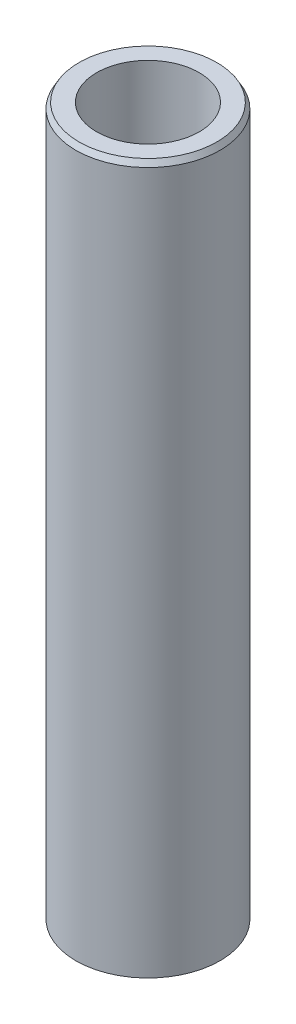
ISO-10303-21;
HEADER;
FILE_DESCRIPTION(('STEP AP214'),'2;1');
FILE_NAME('part.step','',(''),(''),'','','');
FILE_SCHEMA(('AUTOMOTIVE_DESIGN { 1 0 10303 214 1 1 1 1 }'));
ENDSEC;
DATA;
#1=APPLICATION_CONTEXT('core data for automotive mechanical design processes');
#2=APPLICATION_PROTOCOL_DEFINITION('international standard','automotive_design',2000,#1);
#3=PRODUCT_CONTEXT('',#1,'mechanical');
#4=PRODUCT('Part','Part','',(#3));
#5=PRODUCT_RELATED_PRODUCT_CATEGORY('part','',(#4));
#6=PRODUCT_DEFINITION_FORMATION('','',#4);
#7=PRODUCT_DEFINITION_CONTEXT('part definition',#1,'design');
#8=PRODUCT_DEFINITION('design','',#6,#7);
#9=PRODUCT_DEFINITION_SHAPE('','',#8);
#10=(LENGTH_UNIT() NAMED_UNIT(*) SI_UNIT(.MILLI.,.METRE.));
#11=(NAMED_UNIT(*) PLANE_ANGLE_UNIT() SI_UNIT($,.RADIAN.));
#12=(NAMED_UNIT(*) SI_UNIT($,.STERADIAN.) SOLID_ANGLE_UNIT());
#13=UNCERTAINTY_MEASURE_WITH_UNIT(LENGTH_MEASURE(1.E-05),#10,'distance_accuracy_value','');
#14=(GEOMETRIC_REPRESENTATION_CONTEXT(3) GLOBAL_UNCERTAINTY_ASSIGNED_CONTEXT((#13)) GLOBAL_UNIT_ASSIGNED_CONTEXT((#10,
#11,#12)) REPRESENTATION_CONTEXT('',''));
#15=CARTESIAN_POINT('',(0.,0.,0.));
#16=DIRECTION('',(0.,0.,1.));
#17=DIRECTION('',(1.,0.,0.));
#18=AXIS2_PLACEMENT_3D('',#15,#16,#17);
#19=CARTESIAN_POINT('',(0.,320.287423309133,0.));
#20=DIRECTION('',(0.,-1.,0.));
#21=DIRECTION('',(0.,0.,-1.));
#22=AXIS2_PLACEMENT_3D('',#19,#20,#21);
#23=CYLINDRICAL_SURFACE('',#22,32.5);
#24=CARTESIAN_POINT('',(0.,317.764049907247,0.));
#25=DIRECTION('',(0.,1.,0.));
#26=DIRECTION('',(0.,0.,1.));
#27=AXIS2_PLACEMENT_3D('',#24,#25,#26);
#28=CIRCLE('',#27,32.5);
#29=CARTESIAN_POINT('',(0.,317.764049907247,32.5));
#30=VERTEX_POINT('',#29);
#31=EDGE_CURVE('E50',#30,#30,#28,.F.);
#32=ORIENTED_EDGE('',*,*,#31,.T.);
#33=EDGE_LOOP('',(#32));
#34=FACE_BOUND('',#33,.T.);
#35=CARTESIAN_POINT('',(0.,1.45687031284458,0.));
#36=DIRECTION('',(0.,1.,0.));
#37=DIRECTION('',(0.,0.,1.));
#38=AXIS2_PLACEMENT_3D('',#35,#36,#37);
#39=CIRCLE('',#38,32.5);
#40=CARTESIAN_POINT('',(0.,1.45687031284458,32.5));
#41=VERTEX_POINT('',#40);
#42=EDGE_CURVE('E51',#41,#41,#39,.T.);
#43=ORIENTED_EDGE('',*,*,#42,.T.);
#44=EDGE_LOOP('',(#43));
#45=FACE_BOUND('',#44,.T.);
#46=ADVANCED_FACE('F39',(#34,#45),#23,.T.);
#47=CARTESIAN_POINT('',(0.,320.287423309133,0.));
#48=DIRECTION('',(0.,1.,0.));
#49=DIRECTION('',(0.,0.,1.));
#50=AXIS2_PLACEMENT_3D('',#47,#48,#49);
#51=PLANE('',#50);
#52=CARTESIAN_POINT('',(0.,320.287423309133,0.));
#53=DIRECTION('',(0.,1.,0.));
#54=DIRECTION('',(0.,0.,1.));
#55=AXIS2_PLACEMENT_3D('',#52,#53,#54);
#56=CIRCLE('',#55,31.0431296871554);
#57=CARTESIAN_POINT('',(0.,320.287423309133,31.0431296871554));
#58=VERTEX_POINT('',#57);
#59=EDGE_CURVE('E54',#58,#58,#56,.T.);
#60=ORIENTED_EDGE('',*,*,#59,.T.);
#61=EDGE_LOOP('',(#60));
#62=FACE_BOUND('',#61,.T.);
#63=CARTESIAN_POINT('',(0.,320.287423309133,0.));
#64=DIRECTION('',(0.,1.,0.));
#65=DIRECTION('',(0.,0.,1.));
#66=AXIS2_PLACEMENT_3D('',#63,#64,#65);
#67=CIRCLE('',#66,23.1285787841644);
#68=CARTESIAN_POINT('',(0.,320.287423309133,23.1285787841644));
#69=VERTEX_POINT('',#68);
#70=EDGE_CURVE('E58',#69,#69,#67,.T.);
#71=ORIENTED_EDGE('',*,*,#70,.F.);
#72=EDGE_LOOP('',(#71));
#73=FACE_BOUND('',#72,.T.);
#74=ADVANCED_FACE('F69',(#62,#73),#51,.T.);
#75=CARTESIAN_POINT('',(0.,0.,0.));
#76=DIRECTION('',(0.,1.,0.));
#77=DIRECTION('',(0.,0.,1.));
#78=AXIS2_PLACEMENT_3D('',#75,#76,#77);
#79=PLANE('',#78);
#80=CARTESIAN_POINT('',(0.,0.,0.));
#81=DIRECTION('',(0.,1.,0.));
#82=DIRECTION('',(0.,0.,1.));
#83=AXIS2_PLACEMENT_3D('',#80,#81,#82);
#84=CIRCLE('',#83,29.9766265981144);
#85=CARTESIAN_POINT('',(0.,0.,29.9766265981144));
#86=VERTEX_POINT('',#85);
#87=EDGE_CURVE('E10',#86,#86,#84,.F.);
#88=ORIENTED_EDGE('',*,*,#87,.T.);
#89=EDGE_LOOP('',(#88));
#90=FACE_BOUND('',#89,.T.);
#91=CARTESIAN_POINT('',(0.,0.,0.));
#92=DIRECTION('',(0.,1.,0.));
#93=DIRECTION('',(0.,0.,1.));
#94=AXIS2_PLACEMENT_3D('',#91,#92,#93);
#95=CIRCLE('',#94,23.1285787841644);
#96=CARTESIAN_POINT('',(0.,0.,23.1285787841644));
#97=VERTEX_POINT('',#96);
#98=EDGE_CURVE('E63',#97,#97,#95,.T.);
#99=ORIENTED_EDGE('',*,*,#98,.T.);
#100=EDGE_LOOP('',(#99));
#101=FACE_BOUND('',#100,.T.);
#102=ADVANCED_FACE('F75',(#90,#101),#79,.F.);
#103=CARTESIAN_POINT('',(0.,320.287423309133,0.));
#104=DIRECTION('',(0.,-1.,0.));
#105=DIRECTION('',(0.,0.,-1.));
#106=AXIS2_PLACEMENT_3D('',#103,#104,#105);
#107=CYLINDRICAL_SURFACE('',#106,23.1285787841644);
#108=ORIENTED_EDGE('',*,*,#70,.T.);
#109=EDGE_LOOP('',(#108));
#110=FACE_BOUND('',#109,.T.);
#111=ORIENTED_EDGE('',*,*,#98,.F.);
#112=EDGE_LOOP('',(#111));
#113=FACE_BOUND('',#112,.T.);
#114=ADVANCED_FACE('F70',(#110,#113),#107,.F.);
#115=CARTESIAN_POINT('',(0.,320.287423309133,0.));
#116=DIRECTION('',(0.,-1.,0.));
#117=DIRECTION('',(0.,0.,-1.));
#118=AXIS2_PLACEMENT_3D('',#115,#116,#117);
#119=CONICAL_SURFACE('',#118,31.0431296871554,0.523598775598282);
#120=ORIENTED_EDGE('',*,*,#31,.F.);
#121=EDGE_LOOP('',(#120));
#122=FACE_BOUND('',#121,.T.);
#123=ORIENTED_EDGE('',*,*,#59,.F.);
#124=EDGE_LOOP('',(#123));
#125=FACE_BOUND('',#124,.T.);
#126=ADVANCED_FACE('F81',(#122,#125),#119,.T.);
#127=CARTESIAN_POINT('',(0.,1.45687031284458,0.));
#128=DIRECTION('',(0.,1.,0.));
#129=DIRECTION('',(0.,0.,1.));
#130=AXIS2_PLACEMENT_3D('',#127,#128,#129);
#131=CONICAL_SURFACE('',#130,32.5,1.0471975511966);
#132=ORIENTED_EDGE('',*,*,#87,.F.);
#133=EDGE_LOOP('',(#132));
#134=FACE_BOUND('',#133,.T.);
#135=ORIENTED_EDGE('',*,*,#42,.F.);
#136=EDGE_LOOP('',(#135));
#137=FACE_BOUND('',#136,.T.);
#138=ADVANCED_FACE('F45',(#134,#137),#131,.T.);
#139=CLOSED_SHELL('',(#46,#74,#102,#114,#126,#138));
#140=MANIFOLD_SOLID_BREP('B2',#139);
#141=ADVANCED_BREP_SHAPE_REPRESENTATION('',(#18,#140),#14);
#142=SHAPE_DEFINITION_REPRESENTATION(#9,#141);
ENDSEC;
END-ISO-10303-21;
